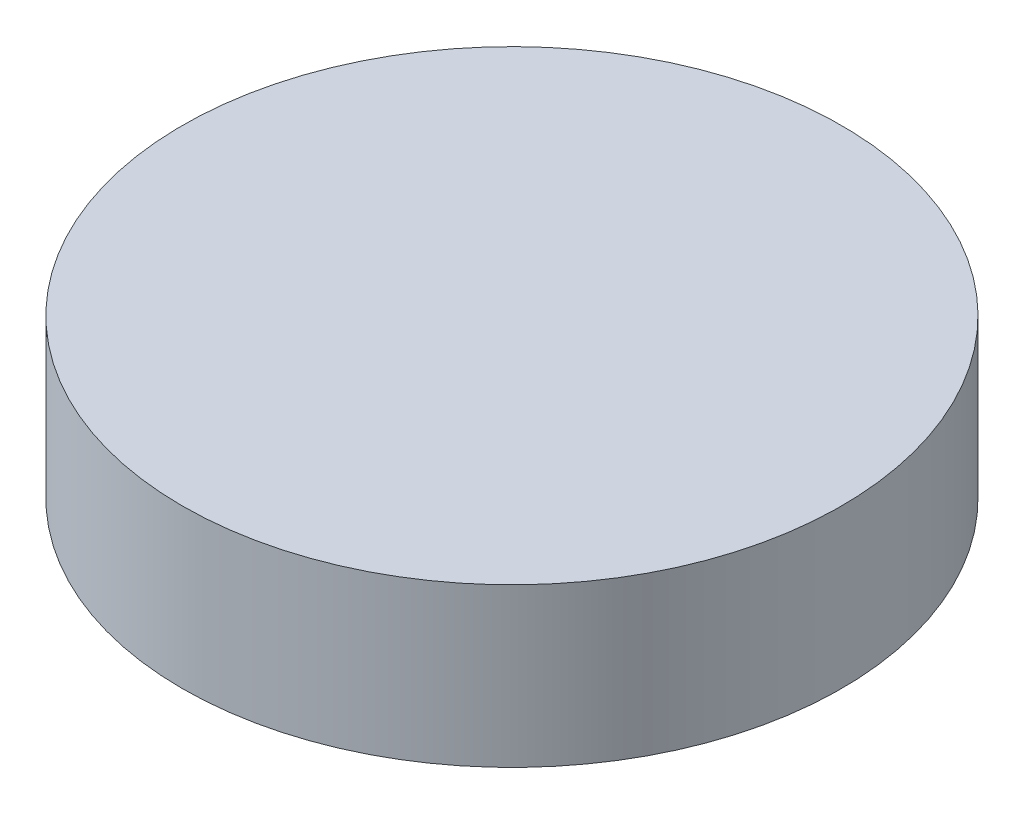
ISO-10303-21;
HEADER;
FILE_DESCRIPTION(('STEP AP214'),'2;1');
FILE_NAME('part.step','',(''),(''),'','','');
FILE_SCHEMA(('AUTOMOTIVE_DESIGN { 1 0 10303 214 1 1 1 1 }'));
ENDSEC;
DATA;
#1=APPLICATION_CONTEXT('core data for automotive mechanical design processes');
#2=APPLICATION_PROTOCOL_DEFINITION('international standard','automotive_design',2000,#1);
#3=PRODUCT_CONTEXT('',#1,'mechanical');
#4=PRODUCT('Part','Part','',(#3));
#5=PRODUCT_RELATED_PRODUCT_CATEGORY('part','',(#4));
#6=PRODUCT_DEFINITION_FORMATION('','',#4);
#7=PRODUCT_DEFINITION_CONTEXT('part definition',#1,'design');
#8=PRODUCT_DEFINITION('design','',#6,#7);
#9=PRODUCT_DEFINITION_SHAPE('','',#8);
#10=(LENGTH_UNIT() NAMED_UNIT(*) SI_UNIT(.MILLI.,.METRE.));
#11=(NAMED_UNIT(*) PLANE_ANGLE_UNIT() SI_UNIT($,.RADIAN.));
#12=(NAMED_UNIT(*) SI_UNIT($,.STERADIAN.) SOLID_ANGLE_UNIT());
#13=UNCERTAINTY_MEASURE_WITH_UNIT(LENGTH_MEASURE(1.E-05),#10,'distance_accuracy_value','');
#14=(GEOMETRIC_REPRESENTATION_CONTEXT(3) GLOBAL_UNCERTAINTY_ASSIGNED_CONTEXT((#13)) GLOBAL_UNIT_ASSIGNED_CONTEXT((#10,
#11,#12)) REPRESENTATION_CONTEXT('',''));
#15=CARTESIAN_POINT('',(0.,0.,0.));
#16=DIRECTION('',(0.,0.,1.));
#17=DIRECTION('',(1.,0.,0.));
#18=AXIS2_PLACEMENT_3D('',#15,#16,#17);
#19=CARTESIAN_POINT('',(0.,6.,0.));
#20=DIRECTION('',(0.,-1.,0.));
#21=DIRECTION('',(0.,0.,-1.));
#22=AXIS2_PLACEMENT_3D('',#19,#20,#21);
#23=CYLINDRICAL_SURFACE('',#22,12.5);
#24=CARTESIAN_POINT('',(0.,6.,0.));
#25=DIRECTION('',(0.,1.,0.));
#26=DIRECTION('',(0.,0.,1.));
#27=AXIS2_PLACEMENT_3D('',#24,#25,#26);
#28=CIRCLE('',#27,12.5);
#29=CARTESIAN_POINT('',(0.,6.,12.5));
#30=VERTEX_POINT('',#29);
#31=EDGE_CURVE('E10',#30,#30,#28,.T.);
#32=ORIENTED_EDGE('',*,*,#31,.F.);
#33=EDGE_LOOP('',(#32));
#34=FACE_BOUND('',#33,.T.);
#35=CARTESIAN_POINT('',(0.,0.,0.));
#36=DIRECTION('',(0.,1.,0.));
#37=DIRECTION('',(0.,0.,1.));
#38=AXIS2_PLACEMENT_3D('',#35,#36,#37);
#39=CIRCLE('',#38,12.5);
#40=CARTESIAN_POINT('',(0.,0.,12.5));
#41=VERTEX_POINT('',#40);
#42=EDGE_CURVE('E38',#41,#41,#39,.T.);
#43=ORIENTED_EDGE('',*,*,#42,.T.);
#44=EDGE_LOOP('',(#43));
#45=FACE_BOUND('',#44,.T.);
#46=ADVANCED_FACE('F35',(#34,#45),#23,.T.);
#47=CARTESIAN_POINT('',(0.,6.,0.));
#48=DIRECTION('',(0.,1.,0.));
#49=DIRECTION('',(0.,0.,1.));
#50=AXIS2_PLACEMENT_3D('',#47,#48,#49);
#51=PLANE('',#50);
#52=ORIENTED_EDGE('',*,*,#31,.T.);
#53=EDGE_LOOP('',(#52));
#54=FACE_BOUND('',#53,.T.);
#55=ADVANCED_FACE('F50',(#54),#51,.T.);
#56=CARTESIAN_POINT('',(0.,0.,0.));
#57=DIRECTION('',(0.,1.,0.));
#58=DIRECTION('',(0.,0.,1.));
#59=AXIS2_PLACEMENT_3D('',#56,#57,#58);
#60=PLANE('',#59);
#61=ORIENTED_EDGE('',*,*,#42,.F.);
#62=EDGE_LOOP('',(#61));
#63=FACE_BOUND('',#62,.T.);
#64=ADVANCED_FACE('F48',(#63),#60,.F.);
#65=CLOSED_SHELL('',(#46,#55,#64));
#66=MANIFOLD_SOLID_BREP('B2',#65);
#67=ADVANCED_BREP_SHAPE_REPRESENTATION('',(#18,#66),#14);
#68=SHAPE_DEFINITION_REPRESENTATION(#9,#67);
ENDSEC;
END-ISO-10303-21;
